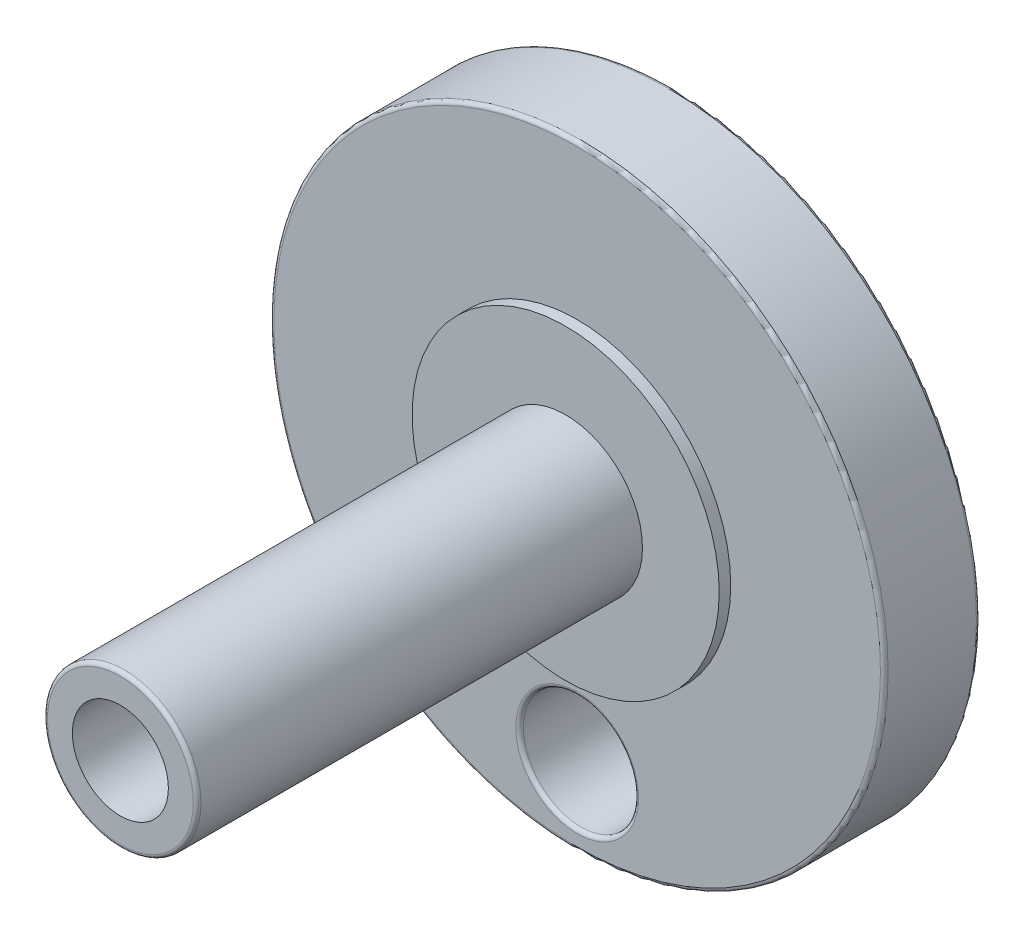
ISO-10303-21;
HEADER;
FILE_DESCRIPTION(('STEP AP214'),'2;1');
FILE_NAME('part.step','',(''),(''),'','','');
FILE_SCHEMA(('AUTOMOTIVE_DESIGN { 1 0 10303 214 1 1 1 1 }'));
ENDSEC;
DATA;
#1=APPLICATION_CONTEXT('core data for automotive mechanical design processes');
#2=APPLICATION_PROTOCOL_DEFINITION('international standard','automotive_design',2000,#1);
#3=PRODUCT_CONTEXT('',#1,'mechanical');
#4=PRODUCT('Part','Part','',(#3));
#5=PRODUCT_RELATED_PRODUCT_CATEGORY('part','',(#4));
#6=PRODUCT_DEFINITION_FORMATION('','',#4);
#7=PRODUCT_DEFINITION_CONTEXT('part definition',#1,'design');
#8=PRODUCT_DEFINITION('design','',#6,#7);
#9=PRODUCT_DEFINITION_SHAPE('','',#8);
#10=(LENGTH_UNIT() NAMED_UNIT(*) SI_UNIT(.MILLI.,.METRE.));
#11=(NAMED_UNIT(*) PLANE_ANGLE_UNIT() SI_UNIT($,.RADIAN.));
#12=(NAMED_UNIT(*) SI_UNIT($,.STERADIAN.) SOLID_ANGLE_UNIT());
#13=UNCERTAINTY_MEASURE_WITH_UNIT(LENGTH_MEASURE(1.E-05),#10,'distance_accuracy_value','');
#14=(GEOMETRIC_REPRESENTATION_CONTEXT(3) GLOBAL_UNCERTAINTY_ASSIGNED_CONTEXT((#13)) GLOBAL_UNIT_ASSIGNED_CONTEXT((#10,
#11,#12)) REPRESENTATION_CONTEXT('',''));
#15=CARTESIAN_POINT('',(0.,0.,0.));
#16=DIRECTION('',(0.,0.,1.));
#17=DIRECTION('',(1.,0.,0.));
#18=AXIS2_PLACEMENT_3D('',#15,#16,#17);
#19=CARTESIAN_POINT('',(0.,0.,2.5));
#20=DIRECTION('',(0.,0.,-1.));
#21=DIRECTION('',(-1.,0.,0.));
#22=AXIS2_PLACEMENT_3D('',#19,#20,#21);
#23=CYLINDRICAL_SURFACE('',#22,8.00000000000001);
#24=CARTESIAN_POINT('',(0.,0.,0.0999999999999998));
#25=DIRECTION('',(0.,0.,1.));
#26=DIRECTION('',(1.,0.,0.));
#27=AXIS2_PLACEMENT_3D('',#24,#25,#26);
#28=CIRCLE('',#27,8.00000000000001);
#29=CARTESIAN_POINT('',(8.00000000000001,0.,0.0999999999999998));
#30=VERTEX_POINT('',#29);
#31=EDGE_CURVE('E110',#30,#30,#28,.T.);
#32=ORIENTED_EDGE('',*,*,#31,.T.);
#33=EDGE_LOOP('',(#32));
#34=FACE_BOUND('',#33,.T.);
#35=CARTESIAN_POINT('',(0.,0.,2.4));
#36=DIRECTION('',(0.,0.,1.));
#37=DIRECTION('',(1.,0.,0.));
#38=AXIS2_PLACEMENT_3D('',#35,#36,#37);
#39=CIRCLE('',#38,8.00000000000001);
#40=CARTESIAN_POINT('',(8.00000000000001,0.,2.4));
#41=VERTEX_POINT('',#40);
#42=EDGE_CURVE('E106',#41,#41,#39,.F.);
#43=ORIENTED_EDGE('',*,*,#42,.T.);
#44=EDGE_LOOP('',(#43));
#45=FACE_BOUND('',#44,.T.);
#46=ADVANCED_FACE('F50',(#34,#45),#23,.T.);
#47=CARTESIAN_POINT('',(0.,0.,2.5));
#48=DIRECTION('',(0.,0.,1.));
#49=DIRECTION('',(1.,0.,0.));
#50=AXIS2_PLACEMENT_3D('',#47,#48,#49);
#51=PLANE('',#50);
#52=CARTESIAN_POINT('',(0.,0.,2.5));
#53=DIRECTION('',(0.,0.,1.));
#54=DIRECTION('',(1.,0.,0.));
#55=AXIS2_PLACEMENT_3D('',#52,#53,#54);
#56=CIRCLE('',#55,7.90000000000001);
#57=CARTESIAN_POINT('',(7.90000000000001,0.,2.5));
#58=VERTEX_POINT('',#57);
#59=EDGE_CURVE('E118',#58,#58,#56,.T.);
#60=ORIENTED_EDGE('',*,*,#59,.T.);
#61=EDGE_LOOP('',(#60));
#62=FACE_BOUND('',#61,.T.);
#63=CARTESIAN_POINT('',(0.,-6.,2.5));
#64=DIRECTION('',(0.,0.,1.));
#65=DIRECTION('',(1.,0.,0.));
#66=AXIS2_PLACEMENT_3D('',#63,#64,#65);
#67=CIRCLE('',#66,1.6);
#68=CARTESIAN_POINT('',(1.6,-6.,2.5));
#69=VERTEX_POINT('',#68);
#70=EDGE_CURVE('E114',#69,#69,#67,.F.);
#71=ORIENTED_EDGE('',*,*,#70,.T.);
#72=EDGE_LOOP('',(#71));
#73=FACE_BOUND('',#72,.T.);
#74=CARTESIAN_POINT('',(0.,0.,2.5));
#75=DIRECTION('',(0.,0.,1.));
#76=DIRECTION('',(1.,0.,0.));
#77=AXIS2_PLACEMENT_3D('',#74,#75,#76);
#78=CIRCLE('',#77,4.);
#79=CARTESIAN_POINT('',(4.,0.,2.5));
#80=VERTEX_POINT('',#79);
#81=EDGE_CURVE('E78',#80,#80,#78,.T.);
#82=ORIENTED_EDGE('',*,*,#81,.F.);
#83=EDGE_LOOP('',(#82));
#84=FACE_BOUND('',#83,.T.);
#85=ADVANCED_FACE('F137',(#62,#73,#84),#51,.T.);
#86=CARTESIAN_POINT('',(0.,0.,0.));
#87=DIRECTION('',(0.,0.,1.));
#88=DIRECTION('',(1.,0.,0.));
#89=AXIS2_PLACEMENT_3D('',#86,#87,#88);
#90=PLANE('',#89);
#91=CARTESIAN_POINT('',(0.,-6.,0.));
#92=DIRECTION('',(0.,0.,1.));
#93=DIRECTION('',(1.,0.,0.));
#94=AXIS2_PLACEMENT_3D('',#91,#92,#93);
#95=CIRCLE('',#94,1.6);
#96=CARTESIAN_POINT('',(1.6,-6.,0.));
#97=VERTEX_POINT('',#96);
#98=EDGE_CURVE('E94',#97,#97,#95,.T.);
#99=ORIENTED_EDGE('',*,*,#98,.T.);
#100=EDGE_LOOP('',(#99));
#101=FACE_BOUND('',#100,.T.);
#102=CARTESIAN_POINT('',(0.,0.,0.));
#103=DIRECTION('',(0.,0.,1.));
#104=DIRECTION('',(1.,0.,0.));
#105=AXIS2_PLACEMENT_3D('',#102,#103,#104);
#106=CIRCLE('',#105,7.90000000000001);
#107=CARTESIAN_POINT('',(7.90000000000001,0.,0.));
#108=VERTEX_POINT('',#107);
#109=EDGE_CURVE('E86',#108,#108,#106,.F.);
#110=ORIENTED_EDGE('',*,*,#109,.T.);
#111=EDGE_LOOP('',(#110));
#112=FACE_BOUND('',#111,.T.);
#113=ADVANCED_FACE('F143',(#101,#112),#90,.F.);
#114=CARTESIAN_POINT('',(0.,0.,2.8));
#115=DIRECTION('',(0.,0.,-1.));
#116=DIRECTION('',(-1.,0.,0.));
#117=AXIS2_PLACEMENT_3D('',#114,#115,#116);
#118=CYLINDRICAL_SURFACE('',#117,4.);
#119=CARTESIAN_POINT('',(0.,0.,2.8));
#120=DIRECTION('',(0.,0.,1.));
#121=DIRECTION('',(1.,0.,0.));
#122=AXIS2_PLACEMENT_3D('',#119,#120,#121);
#123=CIRCLE('',#122,4.);
#124=CARTESIAN_POINT('',(4.,0.,2.8));
#125=VERTEX_POINT('',#124);
#126=EDGE_CURVE('E72',#125,#125,#123,.T.);
#127=ORIENTED_EDGE('',*,*,#126,.F.);
#128=EDGE_LOOP('',(#127));
#129=FACE_BOUND('',#128,.T.);
#130=ORIENTED_EDGE('',*,*,#81,.T.);
#131=EDGE_LOOP('',(#130));
#132=FACE_BOUND('',#131,.T.);
#133=ADVANCED_FACE('F170',(#129,#132),#118,.T.);
#134=CARTESIAN_POINT('',(0.,0.,2.8));
#135=DIRECTION('',(0.,0.,1.));
#136=DIRECTION('',(1.,0.,0.));
#137=AXIS2_PLACEMENT_3D('',#134,#135,#136);
#138=PLANE('',#137);
#139=CARTESIAN_POINT('',(0.,0.,2.8));
#140=DIRECTION('',(0.,0.,1.));
#141=DIRECTION('',(1.,0.,0.));
#142=AXIS2_PLACEMENT_3D('',#139,#140,#141);
#143=CIRCLE('',#142,2.);
#144=CARTESIAN_POINT('',(2.,0.,2.8));
#145=VERTEX_POINT('',#144);
#146=EDGE_CURVE('E83',#145,#145,#143,.T.);
#147=ORIENTED_EDGE('',*,*,#146,.F.);
#148=EDGE_LOOP('',(#147));
#149=FACE_BOUND('',#148,.T.);
#150=ORIENTED_EDGE('',*,*,#126,.T.);
#151=EDGE_LOOP('',(#150));
#152=FACE_BOUND('',#151,.T.);
#153=ADVANCED_FACE('F172',(#149,#152),#138,.T.);
#154=CARTESIAN_POINT('',(0.,0.,14.4));
#155=DIRECTION('',(0.,0.,-1.));
#156=DIRECTION('',(-1.,0.,0.));
#157=AXIS2_PLACEMENT_3D('',#154,#155,#156);
#158=CYLINDRICAL_SURFACE('',#157,2.);
#159=CARTESIAN_POINT('',(0.,0.,14.3));
#160=DIRECTION('',(0.,0.,1.));
#161=DIRECTION('',(1.,0.,0.));
#162=AXIS2_PLACEMENT_3D('',#159,#160,#161);
#163=CIRCLE('',#162,2.);
#164=CARTESIAN_POINT('',(2.,0.,14.3));
#165=VERTEX_POINT('',#164);
#166=EDGE_CURVE('E11',#165,#165,#163,.F.);
#167=ORIENTED_EDGE('',*,*,#166,.T.);
#168=EDGE_LOOP('',(#167));
#169=FACE_BOUND('',#168,.T.);
#170=ORIENTED_EDGE('',*,*,#146,.T.);
#171=EDGE_LOOP('',(#170));
#172=FACE_BOUND('',#171,.T.);
#173=ADVANCED_FACE('F179',(#169,#172),#158,.T.);
#174=CARTESIAN_POINT('',(0.,0.,14.4));
#175=DIRECTION('',(0.,0.,1.));
#176=DIRECTION('',(1.,0.,0.));
#177=AXIS2_PLACEMENT_3D('',#174,#175,#176);
#178=PLANE('',#177);
#179=CARTESIAN_POINT('',(0.,0.,14.4));
#180=DIRECTION('',(0.,0.,1.));
#181=DIRECTION('',(1.,0.,0.));
#182=AXIS2_PLACEMENT_3D('',#179,#180,#181);
#183=CIRCLE('',#182,1.9);
#184=CARTESIAN_POINT('',(1.9,0.,14.4));
#185=VERTEX_POINT('',#184);
#186=EDGE_CURVE('E58',#185,#185,#183,.T.);
#187=ORIENTED_EDGE('',*,*,#186,.T.);
#188=EDGE_LOOP('',(#187));
#189=FACE_BOUND('',#188,.T.);
#190=CARTESIAN_POINT('',(0.,0.,14.4));
#191=DIRECTION('',(0.,0.,1.));
#192=DIRECTION('',(1.,0.,0.));
#193=AXIS2_PLACEMENT_3D('',#190,#191,#192);
#194=CIRCLE('',#193,1.25);
#195=CARTESIAN_POINT('',(1.25,0.,14.4));
#196=VERTEX_POINT('',#195);
#197=EDGE_CURVE('E73',#196,#196,#194,.T.);
#198=ORIENTED_EDGE('',*,*,#197,.F.);
#199=EDGE_LOOP('',(#198));
#200=FACE_BOUND('',#199,.T.);
#201=ADVANCED_FACE('F65',(#189,#200),#178,.T.);
#202=CARTESIAN_POINT('',(0.,0.,5.9));
#203=DIRECTION('',(0.,0.,1.));
#204=DIRECTION('',(1.,0.,0.));
#205=AXIS2_PLACEMENT_3D('',#202,#203,#204);
#206=CONICAL_SURFACE('',#205,1.25,1.02974425867665);
#207=CARTESIAN_POINT('',(0.,0.,5.14892422621555));
#208=VERTEX_POINT('',#207);
#209=VERTEX_LOOP('',#208);
#210=FACE_BOUND('',#209,.T.);
#211=CARTESIAN_POINT('',(0.,0.,5.9));
#212=DIRECTION('',(0.,0.,1.));
#213=DIRECTION('',(1.,0.,0.));
#214=AXIS2_PLACEMENT_3D('',#211,#212,#213);
#215=CIRCLE('',#214,1.25);
#216=CARTESIAN_POINT('',(1.25,0.,5.9));
#217=VERTEX_POINT('',#216);
#218=EDGE_CURVE('E69',#217,#217,#215,.T.);
#219=ORIENTED_EDGE('',*,*,#218,.T.);
#220=EDGE_LOOP('',(#219));
#221=FACE_BOUND('',#220,.T.);
#222=ADVANCED_FACE('F61',(#210,#221),#206,.F.);
#223=CARTESIAN_POINT('',(0.,0.,14.4));
#224=DIRECTION('',(0.,0.,1.));
#225=DIRECTION('',(1.,0.,0.));
#226=AXIS2_PLACEMENT_3D('',#223,#224,#225);
#227=CYLINDRICAL_SURFACE('',#226,1.25);
#228=ORIENTED_EDGE('',*,*,#218,.F.);
#229=EDGE_LOOP('',(#228));
#230=FACE_BOUND('',#229,.T.);
#231=ORIENTED_EDGE('',*,*,#197,.T.);
#232=EDGE_LOOP('',(#231));
#233=FACE_BOUND('',#232,.T.);
#234=ADVANCED_FACE('F64',(#230,#233),#227,.F.);
#235=CARTESIAN_POINT('',(0.,-6.,0.));
#236=DIRECTION('',(0.,0.,1.));
#237=DIRECTION('',(1.,0.,0.));
#238=AXIS2_PLACEMENT_3D('',#235,#236,#237);
#239=CYLINDRICAL_SURFACE('',#238,1.5);
#240=CARTESIAN_POINT('',(0.,-6.,0.1));
#241=DIRECTION('',(0.,0.,1.));
#242=DIRECTION('',(1.,0.,0.));
#243=AXIS2_PLACEMENT_3D('',#240,#241,#242);
#244=CIRCLE('',#243,1.5);
#245=CARTESIAN_POINT('',(1.5,-6.,0.1));
#246=VERTEX_POINT('',#245);
#247=EDGE_CURVE('E102',#246,#246,#244,.F.);
#248=ORIENTED_EDGE('',*,*,#247,.T.);
#249=EDGE_LOOP('',(#248));
#250=FACE_BOUND('',#249,.T.);
#251=CARTESIAN_POINT('',(0.,-6.,2.4));
#252=DIRECTION('',(0.,0.,1.));
#253=DIRECTION('',(1.,0.,0.));
#254=AXIS2_PLACEMENT_3D('',#251,#252,#253);
#255=CIRCLE('',#254,1.5);
#256=CARTESIAN_POINT('',(1.5,-6.,2.4));
#257=VERTEX_POINT('',#256);
#258=EDGE_CURVE('E98',#257,#257,#255,.T.);
#259=ORIENTED_EDGE('',*,*,#258,.T.);
#260=EDGE_LOOP('',(#259));
#261=FACE_BOUND('',#260,.T.);
#262=ADVANCED_FACE('F153',(#250,#261),#239,.F.);
#263=CARTESIAN_POINT('',(0.,-6.,0.1));
#264=DIRECTION('',(0.,0.,1.));
#265=DIRECTION('',(1.,0.,0.));
#266=AXIS2_PLACEMENT_3D('',#263,#264,#265);
#267=TOROIDAL_SURFACE('',#266,1.6,0.1);
#268=ORIENTED_EDGE('',*,*,#247,.F.);
#269=EDGE_LOOP('',(#268));
#270=FACE_BOUND('',#269,.T.);
#271=ORIENTED_EDGE('',*,*,#98,.F.);
#272=EDGE_LOOP('',(#271));
#273=FACE_BOUND('',#272,.T.);
#274=ADVANCED_FACE('F149',(#270,#273),#267,.T.);
#275=CARTESIAN_POINT('',(0.,0.,0.0999999999999998));
#276=DIRECTION('',(0.,0.,1.));
#277=DIRECTION('',(1.,0.,0.));
#278=AXIS2_PLACEMENT_3D('',#275,#276,#277);
#279=TOROIDAL_SURFACE('',#278,7.90000000000001,0.1);
#280=ORIENTED_EDGE('',*,*,#109,.F.);
#281=EDGE_LOOP('',(#280));
#282=FACE_BOUND('',#281,.T.);
#283=ORIENTED_EDGE('',*,*,#31,.F.);
#284=EDGE_LOOP('',(#283));
#285=FACE_BOUND('',#284,.T.);
#286=ADVANCED_FACE('F152',(#282,#285),#279,.T.);
#287=CARTESIAN_POINT('',(0.,0.,2.4));
#288=DIRECTION('',(0.,0.,1.));
#289=DIRECTION('',(1.,0.,0.));
#290=AXIS2_PLACEMENT_3D('',#287,#288,#289);
#291=TOROIDAL_SURFACE('',#290,7.90000000000001,0.1);
#292=ORIENTED_EDGE('',*,*,#42,.F.);
#293=EDGE_LOOP('',(#292));
#294=FACE_BOUND('',#293,.T.);
#295=ORIENTED_EDGE('',*,*,#59,.F.);
#296=EDGE_LOOP('',(#295));
#297=FACE_BOUND('',#296,.T.);
#298=ADVANCED_FACE('F133',(#294,#297),#291,.T.);
#299=CARTESIAN_POINT('',(0.,-6.,2.4));
#300=DIRECTION('',(0.,0.,1.));
#301=DIRECTION('',(1.,0.,0.));
#302=AXIS2_PLACEMENT_3D('',#299,#300,#301);
#303=TOROIDAL_SURFACE('',#302,1.6,0.1);
#304=ORIENTED_EDGE('',*,*,#70,.F.);
#305=EDGE_LOOP('',(#304));
#306=FACE_BOUND('',#305,.T.);
#307=ORIENTED_EDGE('',*,*,#258,.F.);
#308=EDGE_LOOP('',(#307));
#309=FACE_BOUND('',#308,.T.);
#310=ADVANCED_FACE('F128',(#306,#309),#303,.T.);
#311=CARTESIAN_POINT('',(0.,0.,14.3));
#312=DIRECTION('',(0.,0.,1.));
#313=DIRECTION('',(1.,0.,0.));
#314=AXIS2_PLACEMENT_3D('',#311,#312,#313);
#315=TOROIDAL_SURFACE('',#314,1.9,0.1);
#316=ORIENTED_EDGE('',*,*,#166,.F.);
#317=EDGE_LOOP('',(#316));
#318=FACE_BOUND('',#317,.T.);
#319=ORIENTED_EDGE('',*,*,#186,.F.);
#320=EDGE_LOOP('',(#319));
#321=FACE_BOUND('',#320,.T.);
#322=ADVANCED_FACE('F52',(#318,#321),#315,.T.);
#323=CLOSED_SHELL('',(#46,#85,#113,#133,#153,#173,#201,#222,#234,#262,#274,#286,#298,#310,#322));
#324=MANIFOLD_SOLID_BREP('B2',#323);
#325=ADVANCED_BREP_SHAPE_REPRESENTATION('',(#18,#324),#14);
#326=SHAPE_DEFINITION_REPRESENTATION(#9,#325);
ENDSEC;
END-ISO-10303-21;
